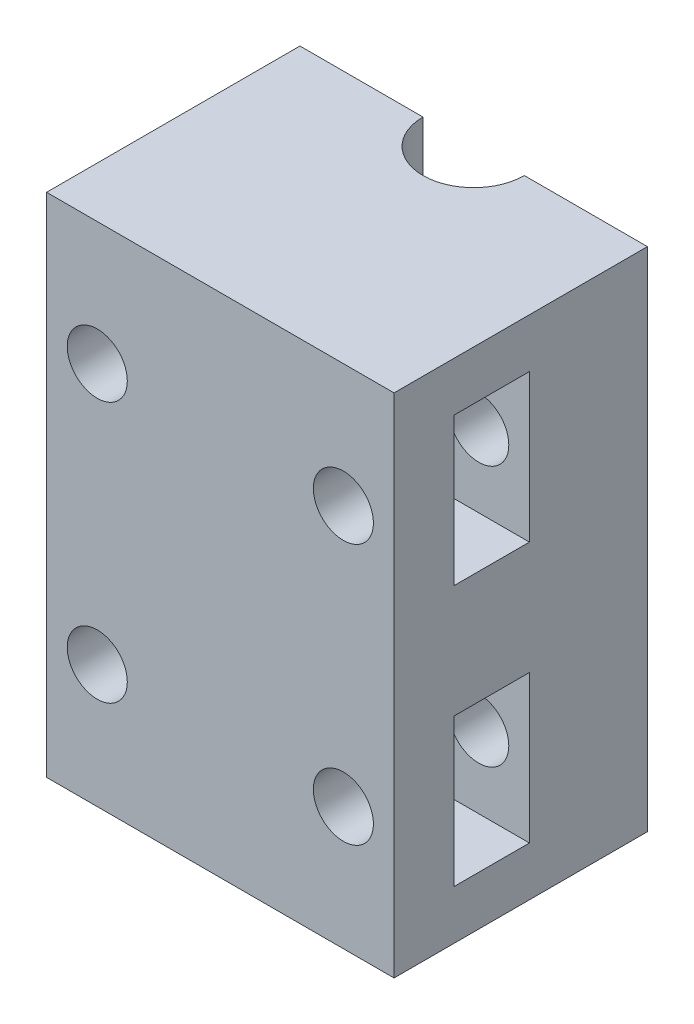
ISO-10303-21;
HEADER;
FILE_DESCRIPTION(('STEP AP214'),'2;1');
FILE_NAME('part.step','',(''),(''),'','','');
FILE_SCHEMA(('AUTOMOTIVE_DESIGN { 1 0 10303 214 1 1 1 1 }'));
ENDSEC;
DATA;
#1=APPLICATION_CONTEXT('core data for automotive mechanical design processes');
#2=APPLICATION_PROTOCOL_DEFINITION('international standard','automotive_design',2000,#1);
#3=PRODUCT_CONTEXT('',#1,'mechanical');
#4=PRODUCT('Part','Part','',(#3));
#5=PRODUCT_RELATED_PRODUCT_CATEGORY('part','',(#4));
#6=PRODUCT_DEFINITION_FORMATION('','',#4);
#7=PRODUCT_DEFINITION_CONTEXT('part definition',#1,'design');
#8=PRODUCT_DEFINITION('design','',#6,#7);
#9=PRODUCT_DEFINITION_SHAPE('','',#8);
#10=(LENGTH_UNIT() NAMED_UNIT(*) SI_UNIT(.MILLI.,.METRE.));
#11=(NAMED_UNIT(*) PLANE_ANGLE_UNIT() SI_UNIT($,.RADIAN.));
#12=(NAMED_UNIT(*) SI_UNIT($,.STERADIAN.) SOLID_ANGLE_UNIT());
#13=UNCERTAINTY_MEASURE_WITH_UNIT(LENGTH_MEASURE(1.E-05),#10,'distance_accuracy_value','');
#14=(GEOMETRIC_REPRESENTATION_CONTEXT(3) GLOBAL_UNCERTAINTY_ASSIGNED_CONTEXT((#13)) GLOBAL_UNIT_ASSIGNED_CONTEXT((#10,
#11,#12)) REPRESENTATION_CONTEXT('',''));
#15=CARTESIAN_POINT('',(0.,0.,0.));
#16=DIRECTION('',(0.,0.,1.));
#17=DIRECTION('',(1.,0.,0.));
#18=AXIS2_PLACEMENT_3D('',#15,#16,#17);
#19=CARTESIAN_POINT('',(24.,70.,-17.5));
#20=DIRECTION('',(0.,0.,1.));
#21=DIRECTION('',(1.,0.,0.));
#22=AXIS2_PLACEMENT_3D('',#19,#20,#21);
#23=PLANE('',#22);
#24=CARTESIAN_POINT('',(-17.,53.,-17.5));
#25=DIRECTION('',(0.,0.,1.));
#26=DIRECTION('',(1.,0.,0.));
#27=AXIS2_PLACEMENT_3D('',#24,#25,#26);
#28=CIRCLE('',#27,4.15);
#29=CARTESIAN_POINT('',(-12.85,53.,-17.5));
#30=VERTEX_POINT('',#29);
#31=EDGE_CURVE('E223',#30,#30,#28,.T.);
#32=ORIENTED_EDGE('',*,*,#31,.T.);
#33=EDGE_LOOP('',(#32));
#34=FACE_BOUND('',#33,.T.);
#35=CARTESIAN_POINT('',(-17.,17.,-17.5));
#36=DIRECTION('',(0.,0.,1.));
#37=DIRECTION('',(1.,0.,0.));
#38=AXIS2_PLACEMENT_3D('',#35,#36,#37);
#39=CIRCLE('',#38,4.15);
#40=CARTESIAN_POINT('',(-12.85,17.,-17.5));
#41=VERTEX_POINT('',#40);
#42=EDGE_CURVE('E198',#41,#41,#39,.T.);
#43=ORIENTED_EDGE('',*,*,#42,.T.);
#44=EDGE_LOOP('',(#43));
#45=FACE_BOUND('',#44,.T.);
#46=DIRECTION('',(0.,-1.,0.));
#47=VECTOR('',#46,1.);
#48=CARTESIAN_POINT('',(-7.,249.629897921023,-17.5));
#49=LINE('',#48,#47);
#50=CARTESIAN_POINT('',(-7.,70.,-17.5));
#51=VERTEX_POINT('',#50);
#52=CARTESIAN_POINT('',(-7.,0.,-17.5));
#53=VERTEX_POINT('',#52);
#54=EDGE_CURVE('E181',#51,#53,#49,.T.);
#55=ORIENTED_EDGE('',*,*,#54,.T.);
#56=DIRECTION('',(-1.,0.,0.));
#57=VECTOR('',#56,1.);
#58=CARTESIAN_POINT('',(24.,0.,-17.5));
#59=LINE('',#58,#57);
#60=CARTESIAN_POINT('',(-24.,0.,-17.5));
#61=VERTEX_POINT('',#60);
#62=EDGE_CURVE('E168',#53,#61,#59,.T.);
#63=ORIENTED_EDGE('',*,*,#62,.T.);
#64=DIRECTION('',(0.,-1.,0.));
#65=VECTOR('',#64,1.);
#66=CARTESIAN_POINT('',(-24.,70.,-17.5));
#67=LINE('',#66,#65);
#68=CARTESIAN_POINT('',(-24.,70.,-17.5));
#69=VERTEX_POINT('',#68);
#70=EDGE_CURVE('E308',#69,#61,#67,.T.);
#71=ORIENTED_EDGE('',*,*,#70,.F.);
#72=DIRECTION('',(-1.,0.,0.));
#73=VECTOR('',#72,1.);
#74=CARTESIAN_POINT('',(24.,70.,-17.5));
#75=LINE('',#74,#73);
#76=EDGE_CURVE('E182',#51,#69,#75,.T.);
#77=ORIENTED_EDGE('',*,*,#76,.F.);
#78=EDGE_LOOP('',(#55,#63,#71,#77));
#79=FACE_BOUND('',#78,.T.);
#80=ADVANCED_FACE('F42',(#34,#45,#79),#23,.F.);
#81=CARTESIAN_POINT('',(17.,17.,-17.5));
#82=DIRECTION('',(0.,0.,1.));
#83=DIRECTION('',(1.,0.,0.));
#84=AXIS2_PLACEMENT_3D('',#81,#82,#83);
#85=CIRCLE('',#84,4.15);
#86=CARTESIAN_POINT('',(21.15,17.,-17.5));
#87=VERTEX_POINT('',#86);
#88=EDGE_CURVE('E204',#87,#87,#85,.T.);
#89=ORIENTED_EDGE('',*,*,#88,.T.);
#90=EDGE_LOOP('',(#89));
#91=FACE_BOUND('',#90,.T.);
#92=CARTESIAN_POINT('',(17.,53.,-17.5));
#93=DIRECTION('',(0.,0.,1.));
#94=DIRECTION('',(1.,0.,0.));
#95=AXIS2_PLACEMENT_3D('',#92,#93,#94);
#96=CIRCLE('',#95,4.15);
#97=CARTESIAN_POINT('',(21.15,53.,-17.5));
#98=VERTEX_POINT('',#97);
#99=EDGE_CURVE('E191',#98,#98,#96,.T.);
#100=ORIENTED_EDGE('',*,*,#99,.T.);
#101=EDGE_LOOP('',(#100));
#102=FACE_BOUND('',#101,.T.);
#103=DIRECTION('',(0.,-1.,0.));
#104=VECTOR('',#103,1.);
#105=CARTESIAN_POINT('',(7.,249.629897921023,-17.5));
#106=LINE('',#105,#104);
#107=CARTESIAN_POINT('',(7.,70.,-17.5));
#108=VERTEX_POINT('',#107);
#109=CARTESIAN_POINT('',(7.,0.,-17.5));
#110=VERTEX_POINT('',#109);
#111=EDGE_CURVE('E65',#108,#110,#106,.T.);
#112=ORIENTED_EDGE('',*,*,#111,.F.);
#113=CARTESIAN_POINT('',(24.,70.,-17.5));
#114=VERTEX_POINT('',#113);
#115=EDGE_CURVE('E306',#114,#108,#75,.T.);
#116=ORIENTED_EDGE('',*,*,#115,.F.);
#117=DIRECTION('',(0.,-1.,0.));
#118=VECTOR('',#117,1.);
#119=CARTESIAN_POINT('',(24.,70.,-17.5));
#120=LINE('',#119,#118);
#121=CARTESIAN_POINT('',(24.,0.,-17.5));
#122=VERTEX_POINT('',#121);
#123=EDGE_CURVE('E315',#114,#122,#120,.T.);
#124=ORIENTED_EDGE('',*,*,#123,.T.);
#125=EDGE_CURVE('E177',#122,#110,#59,.T.);
#126=ORIENTED_EDGE('',*,*,#125,.T.);
#127=EDGE_LOOP('',(#112,#116,#124,#126));
#128=FACE_BOUND('',#127,.T.);
#129=ADVANCED_FACE('F359',(#91,#102,#128),#23,.F.);
#130=CARTESIAN_POINT('',(0.,70.,0.));
#131=DIRECTION('',(0.,1.,0.));
#132=DIRECTION('',(0.,0.,1.));
#133=AXIS2_PLACEMENT_3D('',#130,#131,#132);
#134=PLANE('',#133);
#135=ORIENTED_EDGE('',*,*,#115,.T.);
#136=CARTESIAN_POINT('',(0.,70.,-17.5));
#137=DIRECTION('',(0.,1.,0.));
#138=DIRECTION('',(0.,0.,1.));
#139=AXIS2_PLACEMENT_3D('',#136,#137,#138);
#140=CIRCLE('',#139,7.);
#141=EDGE_CURVE('E57',#108,#51,#140,.F.);
#142=ORIENTED_EDGE('',*,*,#141,.T.);
#143=ORIENTED_EDGE('',*,*,#76,.T.);
#144=DIRECTION('',(0.,0.,1.));
#145=VECTOR('',#144,1.);
#146=CARTESIAN_POINT('',(-24.,70.,17.5));
#147=LINE('',#146,#145);
#148=CARTESIAN_POINT('',(-24.,70.,17.5));
#149=VERTEX_POINT('',#148);
#150=EDGE_CURVE('E298',#69,#149,#147,.T.);
#151=ORIENTED_EDGE('',*,*,#150,.T.);
#152=DIRECTION('',(1.,0.,0.));
#153=VECTOR('',#152,1.);
#154=CARTESIAN_POINT('',(24.,70.,17.5));
#155=LINE('',#154,#153);
#156=CARTESIAN_POINT('',(24.,70.,17.5));
#157=VERTEX_POINT('',#156);
#158=EDGE_CURVE('E301',#149,#157,#155,.T.);
#159=ORIENTED_EDGE('',*,*,#158,.T.);
#160=DIRECTION('',(0.,0.,-1.));
#161=VECTOR('',#160,1.);
#162=CARTESIAN_POINT('',(24.,70.,17.5));
#163=LINE('',#162,#161);
#164=EDGE_CURVE('E303',#157,#114,#163,.T.);
#165=ORIENTED_EDGE('',*,*,#164,.T.);
#166=EDGE_LOOP('',(#135,#142,#143,#151,#159,#165));
#167=FACE_BOUND('',#166,.T.);
#168=ADVANCED_FACE('F365',(#167),#134,.T.);
#169=CARTESIAN_POINT('',(0.,0.,0.));
#170=DIRECTION('',(0.,1.,0.));
#171=DIRECTION('',(0.,0.,1.));
#172=AXIS2_PLACEMENT_3D('',#169,#170,#171);
#173=PLANE('',#172);
#174=CARTESIAN_POINT('',(0.,0.,-17.5));
#175=DIRECTION('',(0.,1.,0.));
#176=DIRECTION('',(0.,0.,1.));
#177=AXIS2_PLACEMENT_3D('',#174,#175,#176);
#178=CIRCLE('',#177,7.);
#179=EDGE_CURVE('E12',#110,#53,#178,.F.);
#180=ORIENTED_EDGE('',*,*,#179,.F.);
#181=ORIENTED_EDGE('',*,*,#125,.F.);
#182=DIRECTION('',(0.,0.,-1.));
#183=VECTOR('',#182,1.);
#184=CARTESIAN_POINT('',(24.,0.,17.5));
#185=LINE('',#184,#183);
#186=CARTESIAN_POINT('',(24.,0.,17.5));
#187=VERTEX_POINT('',#186);
#188=EDGE_CURVE('E178',#187,#122,#185,.T.);
#189=ORIENTED_EDGE('',*,*,#188,.F.);
#190=DIRECTION('',(1.,0.,0.));
#191=VECTOR('',#190,1.);
#192=CARTESIAN_POINT('',(24.,0.,17.5));
#193=LINE('',#192,#191);
#194=CARTESIAN_POINT('',(-24.,0.,17.5));
#195=VERTEX_POINT('',#194);
#196=EDGE_CURVE('E310',#195,#187,#193,.T.);
#197=ORIENTED_EDGE('',*,*,#196,.F.);
#198=DIRECTION('',(0.,0.,1.));
#199=VECTOR('',#198,1.);
#200=CARTESIAN_POINT('',(-24.,0.,17.5));
#201=LINE('',#200,#199);
#202=EDGE_CURVE('E173',#61,#195,#201,.T.);
#203=ORIENTED_EDGE('',*,*,#202,.F.);
#204=ORIENTED_EDGE('',*,*,#62,.F.);
#205=EDGE_LOOP('',(#180,#181,#189,#197,#203,#204));
#206=FACE_BOUND('',#205,.T.);
#207=ADVANCED_FACE('F170',(#206),#173,.F.);
#208=CARTESIAN_POINT('',(-21.,70.,17.5));
#209=DIRECTION('',(1.,0.,0.));
#210=DIRECTION('',(0.,0.,-1.));
#211=AXIS2_PLACEMENT_3D('',#208,#209,#210);
#212=PLANE('',#211);
#213=DIRECTION('',(0.,0.,1.));
#214=VECTOR('',#213,1.);
#215=CARTESIAN_POINT('',(-21.,18.1056672193748,-17.5));
#216=LINE('',#215,#214);
#217=CARTESIAN_POINT('',(-21.,18.1056672193748,-1.20000000000001));
#218=VERTEX_POINT('',#217);
#219=CARTESIAN_POINT('',(-21.,18.1056672193748,9.19999999999999));
#220=VERTEX_POINT('',#219);
#221=EDGE_CURVE('E50',#218,#220,#216,.T.);
#222=ORIENTED_EDGE('',*,*,#221,.F.);
#223=DIRECTION('',(0.,-1.,0.));
#224=VECTOR('',#223,1.);
#225=CARTESIAN_POINT('',(-21.,6.8,-1.20000000000001));
#226=LINE('',#225,#224);
#227=CARTESIAN_POINT('',(-21.,27.2,-1.20000000000001));
#228=VERTEX_POINT('',#227);
#229=EDGE_CURVE('E235',#228,#218,#226,.T.);
#230=ORIENTED_EDGE('',*,*,#229,.F.);
#231=DIRECTION('',(0.,0.,-1.));
#232=VECTOR('',#231,1.);
#233=CARTESIAN_POINT('',(-21.,27.2,-1.20000000000001));
#234=LINE('',#233,#232);
#235=CARTESIAN_POINT('',(-21.,27.2,9.19999999999999));
#236=VERTEX_POINT('',#235);
#237=EDGE_CURVE('E238',#236,#228,#234,.T.);
#238=ORIENTED_EDGE('',*,*,#237,.F.);
#239=DIRECTION('',(0.,1.,0.));
#240=VECTOR('',#239,1.);
#241=CARTESIAN_POINT('',(-21.,6.8,9.19999999999999));
#242=LINE('',#241,#240);
#243=EDGE_CURVE('E241',#220,#236,#242,.T.);
#244=ORIENTED_EDGE('',*,*,#243,.F.);
#245=EDGE_LOOP('',(#222,#230,#238,#244));
#246=FACE_BOUND('',#245,.T.);
#247=ADVANCED_FACE('F402',(#246),#212,.T.);
#248=CARTESIAN_POINT('',(-21.,70.,17.5));
#249=DIRECTION('',(1.,0.,0.));
#250=DIRECTION('',(0.,0.,-1.));
#251=AXIS2_PLACEMENT_3D('',#248,#249,#250);
#252=PLANE('',#251);
#253=DIRECTION('',(0.,0.,1.));
#254=VECTOR('',#253,1.);
#255=CARTESIAN_POINT('',(-21.,54.1056672193749,-17.5));
#256=LINE('',#255,#254);
#257=CARTESIAN_POINT('',(-21.,54.1056672193749,-1.20000000000001));
#258=VERTEX_POINT('',#257);
#259=CARTESIAN_POINT('',(-21.,54.1056672193749,9.19999999999999));
#260=VERTEX_POINT('',#259);
#261=EDGE_CURVE('E328',#258,#260,#256,.T.);
#262=ORIENTED_EDGE('',*,*,#261,.F.);
#263=DIRECTION('',(0.,-1.,0.));
#264=VECTOR('',#263,1.);
#265=CARTESIAN_POINT('',(-21.,42.8,-1.20000000000001));
#266=LINE('',#265,#264);
#267=CARTESIAN_POINT('',(-21.,63.2,-1.20000000000001));
#268=VERTEX_POINT('',#267);
#269=EDGE_CURVE('E267',#268,#258,#266,.T.);
#270=ORIENTED_EDGE('',*,*,#269,.F.);
#271=DIRECTION('',(0.,0.,-1.));
#272=VECTOR('',#271,1.);
#273=CARTESIAN_POINT('',(-21.,63.2,-1.20000000000001));
#274=LINE('',#273,#272);
#275=CARTESIAN_POINT('',(-21.,63.2,9.19999999999999));
#276=VERTEX_POINT('',#275);
#277=EDGE_CURVE('E270',#276,#268,#274,.T.);
#278=ORIENTED_EDGE('',*,*,#277,.F.);
#279=DIRECTION('',(0.,1.,0.));
#280=VECTOR('',#279,1.);
#281=CARTESIAN_POINT('',(-21.,42.8,9.19999999999999));
#282=LINE('',#281,#280);
#283=EDGE_CURVE('E273',#260,#276,#282,.T.);
#284=ORIENTED_EDGE('',*,*,#283,.F.);
#285=EDGE_LOOP('',(#262,#270,#278,#284));
#286=FACE_BOUND('',#285,.T.);
#287=ADVANCED_FACE('F381',(#286),#252,.T.);
#288=CARTESIAN_POINT('',(-24.,70.,17.5));
#289=DIRECTION('',(1.,0.,0.));
#290=DIRECTION('',(0.,0.,-1.));
#291=AXIS2_PLACEMENT_3D('',#288,#289,#290);
#292=PLANE('',#291);
#293=ORIENTED_EDGE('',*,*,#202,.T.);
#294=DIRECTION('',(0.,-1.,0.));
#295=VECTOR('',#294,1.);
#296=CARTESIAN_POINT('',(-24.,70.,17.5));
#297=LINE('',#296,#295);
#298=EDGE_CURVE('E323',#149,#195,#297,.T.);
#299=ORIENTED_EDGE('',*,*,#298,.F.);
#300=ORIENTED_EDGE('',*,*,#150,.F.);
#301=ORIENTED_EDGE('',*,*,#70,.T.);
#302=EDGE_LOOP('',(#293,#299,#300,#301));
#303=FACE_BOUND('',#302,.T.);
#304=ADVANCED_FACE('F44',(#303),#292,.F.);
#305=CARTESIAN_POINT('',(24.,70.,17.5));
#306=DIRECTION('',(0.,0.,-1.));
#307=DIRECTION('',(-1.,0.,0.));
#308=AXIS2_PLACEMENT_3D('',#305,#306,#307);
#309=PLANE('',#308);
#310=CARTESIAN_POINT('',(17.,53.,17.5));
#311=DIRECTION('',(0.,0.,1.));
#312=DIRECTION('',(1.,0.,0.));
#313=AXIS2_PLACEMENT_3D('',#310,#311,#312);
#314=CIRCLE('',#313,4.15);
#315=CARTESIAN_POINT('',(21.15,53.,17.5));
#316=VERTEX_POINT('',#315);
#317=EDGE_CURVE('E195',#316,#316,#314,.T.);
#318=ORIENTED_EDGE('',*,*,#317,.F.);
#319=EDGE_LOOP('',(#318));
#320=FACE_BOUND('',#319,.T.);
#321=CARTESIAN_POINT('',(-17.,17.,17.5));
#322=DIRECTION('',(0.,0.,1.));
#323=DIRECTION('',(1.,0.,0.));
#324=AXIS2_PLACEMENT_3D('',#321,#322,#323);
#325=CIRCLE('',#324,4.15);
#326=CARTESIAN_POINT('',(-12.85,17.,17.5));
#327=VERTEX_POINT('',#326);
#328=EDGE_CURVE('E201',#327,#327,#325,.T.);
#329=ORIENTED_EDGE('',*,*,#328,.F.);
#330=EDGE_LOOP('',(#329));
#331=FACE_BOUND('',#330,.T.);
#332=CARTESIAN_POINT('',(17.,17.,17.5));
#333=DIRECTION('',(0.,0.,1.));
#334=DIRECTION('',(1.,0.,0.));
#335=AXIS2_PLACEMENT_3D('',#332,#333,#334);
#336=CIRCLE('',#335,4.15);
#337=CARTESIAN_POINT('',(21.15,17.,17.5));
#338=VERTEX_POINT('',#337);
#339=EDGE_CURVE('E188',#338,#338,#336,.T.);
#340=ORIENTED_EDGE('',*,*,#339,.F.);
#341=EDGE_LOOP('',(#340));
#342=FACE_BOUND('',#341,.T.);
#343=CARTESIAN_POINT('',(-17.,53.,17.5));
#344=DIRECTION('',(0.,0.,1.));
#345=DIRECTION('',(1.,0.,0.));
#346=AXIS2_PLACEMENT_3D('',#343,#344,#345);
#347=CIRCLE('',#346,4.15);
#348=CARTESIAN_POINT('',(-12.85,53.,17.5));
#349=VERTEX_POINT('',#348);
#350=EDGE_CURVE('E222',#349,#349,#347,.T.);
#351=ORIENTED_EDGE('',*,*,#350,.F.);
#352=EDGE_LOOP('',(#351));
#353=FACE_BOUND('',#352,.T.);
#354=ORIENTED_EDGE('',*,*,#196,.T.);
#355=DIRECTION('',(0.,-1.,0.));
#356=VECTOR('',#355,1.);
#357=CARTESIAN_POINT('',(24.,70.,17.5));
#358=LINE('',#357,#356);
#359=EDGE_CURVE('E319',#157,#187,#358,.T.);
#360=ORIENTED_EDGE('',*,*,#359,.F.);
#361=ORIENTED_EDGE('',*,*,#158,.F.);
#362=ORIENTED_EDGE('',*,*,#298,.T.);
#363=EDGE_LOOP('',(#354,#360,#361,#362));
#364=FACE_BOUND('',#363,.T.);
#365=ADVANCED_FACE('F374',(#320,#331,#342,#353,#364),#309,.F.);
#366=CARTESIAN_POINT('',(24.,70.,17.5));
#367=DIRECTION('',(-1.,0.,0.));
#368=DIRECTION('',(0.,0.,1.));
#369=AXIS2_PLACEMENT_3D('',#366,#367,#368);
#370=PLANE('',#369);
#371=DIRECTION('',(0.,0.,-1.));
#372=VECTOR('',#371,1.);
#373=CARTESIAN_POINT('',(24.,6.8,-1.20000000000001));
#374=LINE('',#373,#372);
#375=CARTESIAN_POINT('',(24.,6.8,9.19999999999999));
#376=VERTEX_POINT('',#375);
#377=CARTESIAN_POINT('',(24.,6.8,-1.20000000000001));
#378=VERTEX_POINT('',#377);
#379=EDGE_CURVE('E247',#376,#378,#374,.T.);
#380=ORIENTED_EDGE('',*,*,#379,.F.);
#381=DIRECTION('',(0.,-1.,0.));
#382=VECTOR('',#381,1.);
#383=CARTESIAN_POINT('',(24.,6.8,9.19999999999999));
#384=LINE('',#383,#382);
#385=CARTESIAN_POINT('',(24.,27.2,9.19999999999999));
#386=VERTEX_POINT('',#385);
#387=EDGE_CURVE('E234',#386,#376,#384,.T.);
#388=ORIENTED_EDGE('',*,*,#387,.F.);
#389=DIRECTION('',(0.,0.,1.));
#390=VECTOR('',#389,1.);
#391=CARTESIAN_POINT('',(24.,27.2,-1.20000000000001));
#392=LINE('',#391,#390);
#393=CARTESIAN_POINT('',(24.,27.2,-1.20000000000001));
#394=VERTEX_POINT('',#393);
#395=EDGE_CURVE('E253',#394,#386,#392,.T.);
#396=ORIENTED_EDGE('',*,*,#395,.F.);
#397=DIRECTION('',(0.,1.,0.));
#398=VECTOR('',#397,1.);
#399=CARTESIAN_POINT('',(24.,6.8,-1.20000000000001));
#400=LINE('',#399,#398);
#401=EDGE_CURVE('E250',#378,#394,#400,.T.);
#402=ORIENTED_EDGE('',*,*,#401,.F.);
#403=EDGE_LOOP('',(#380,#388,#396,#402));
#404=FACE_BOUND('',#403,.T.);
#405=DIRECTION('',(0.,0.,-1.));
#406=VECTOR('',#405,1.);
#407=CARTESIAN_POINT('',(24.,42.8,-1.20000000000001));
#408=LINE('',#407,#406);
#409=CARTESIAN_POINT('',(24.,42.8,9.19999999999999));
#410=VERTEX_POINT('',#409);
#411=CARTESIAN_POINT('',(24.,42.8,-1.20000000000001));
#412=VERTEX_POINT('',#411);
#413=EDGE_CURVE('E279',#410,#412,#408,.T.);
#414=ORIENTED_EDGE('',*,*,#413,.F.);
#415=DIRECTION('',(0.,-1.,0.));
#416=VECTOR('',#415,1.);
#417=CARTESIAN_POINT('',(24.,42.8,9.19999999999999));
#418=LINE('',#417,#416);
#419=CARTESIAN_POINT('',(24.,63.2,9.19999999999999));
#420=VERTEX_POINT('',#419);
#421=EDGE_CURVE('E266',#420,#410,#418,.T.);
#422=ORIENTED_EDGE('',*,*,#421,.F.);
#423=DIRECTION('',(0.,0.,1.));
#424=VECTOR('',#423,1.);
#425=CARTESIAN_POINT('',(24.,63.2,-1.20000000000001));
#426=LINE('',#425,#424);
#427=CARTESIAN_POINT('',(24.,63.2,-1.20000000000001));
#428=VERTEX_POINT('',#427);
#429=EDGE_CURVE('E285',#428,#420,#426,.T.);
#430=ORIENTED_EDGE('',*,*,#429,.F.);
#431=DIRECTION('',(0.,1.,0.));
#432=VECTOR('',#431,1.);
#433=CARTESIAN_POINT('',(24.,42.8,-1.20000000000001));
#434=LINE('',#433,#432);
#435=EDGE_CURVE('E282',#412,#428,#434,.T.);
#436=ORIENTED_EDGE('',*,*,#435,.F.);
#437=EDGE_LOOP('',(#414,#422,#430,#436));
#438=FACE_BOUND('',#437,.T.);
#439=ORIENTED_EDGE('',*,*,#188,.T.);
#440=ORIENTED_EDGE('',*,*,#123,.F.);
#441=ORIENTED_EDGE('',*,*,#164,.F.);
#442=ORIENTED_EDGE('',*,*,#359,.T.);
#443=EDGE_LOOP('',(#439,#440,#441,#442));
#444=FACE_BOUND('',#443,.T.);
#445=ADVANCED_FACE('F371',(#404,#438,#444),#370,.F.);
#446=CARTESIAN_POINT('',(-46.8980348501788,42.8,9.19999999999999));
#447=DIRECTION('',(0.,0.,1.));
#448=DIRECTION('',(1.,0.,0.));
#449=AXIS2_PLACEMENT_3D('',#446,#447,#448);
#450=PLANE('',#449);
#451=CARTESIAN_POINT('',(17.,53.,9.19999999999999));
#452=DIRECTION('',(0.,0.,1.));
#453=DIRECTION('',(1.,0.,0.));
#454=AXIS2_PLACEMENT_3D('',#451,#452,#453);
#455=CIRCLE('',#454,4.15);
#456=CARTESIAN_POINT('',(21.15,53.,9.19999999999999));
#457=VERTEX_POINT('',#456);
#458=EDGE_CURVE('E219',#457,#457,#455,.T.);
#459=ORIENTED_EDGE('',*,*,#458,.T.);
#460=EDGE_LOOP('',(#459));
#461=FACE_BOUND('',#460,.T.);
#462=CARTESIAN_POINT('',(-21.,42.8,9.19999999999999));
#463=VERTEX_POINT('',#462);
#464=CARTESIAN_POINT('',(-21.,51.8943327806251,9.19999999999999));
#465=VERTEX_POINT('',#464);
#466=EDGE_CURVE('E274',#463,#465,#282,.T.);
#467=ORIENTED_EDGE('',*,*,#466,.T.);
#468=CARTESIAN_POINT('',(-17.,53.,9.19999999999999));
#469=DIRECTION('',(0.,0.,1.));
#470=DIRECTION('',(1.,0.,0.));
#471=AXIS2_PLACEMENT_3D('',#468,#469,#470);
#472=CIRCLE('',#471,4.15);
#473=EDGE_CURVE('E231',#465,#260,#472,.T.);
#474=ORIENTED_EDGE('',*,*,#473,.T.);
#475=ORIENTED_EDGE('',*,*,#283,.T.);
#476=DIRECTION('',(1.,0.,0.));
#477=VECTOR('',#476,1.);
#478=CARTESIAN_POINT('',(-46.8980348501788,63.2,9.19999999999999));
#479=LINE('',#478,#477);
#480=EDGE_CURVE('E289',#276,#420,#479,.T.);
#481=ORIENTED_EDGE('',*,*,#480,.T.);
#482=ORIENTED_EDGE('',*,*,#421,.T.);
#483=DIRECTION('',(1.,0.,0.));
#484=VECTOR('',#483,1.);
#485=CARTESIAN_POINT('',(-46.8980348501788,42.8,9.19999999999999));
#486=LINE('',#485,#484);
#487=EDGE_CURVE('E288',#463,#410,#486,.T.);
#488=ORIENTED_EDGE('',*,*,#487,.F.);
#489=EDGE_LOOP('',(#467,#474,#475,#481,#482,#488));
#490=FACE_BOUND('',#489,.T.);
#491=ADVANCED_FACE('F373',(#461,#490),#450,.F.);
#492=CARTESIAN_POINT('',(-46.8980348501788,63.2,-1.20000000000001));
#493=DIRECTION('',(0.,1.,0.));
#494=DIRECTION('',(0.,0.,1.));
#495=AXIS2_PLACEMENT_3D('',#492,#493,#494);
#496=PLANE('',#495);
#497=ORIENTED_EDGE('',*,*,#277,.T.);
#498=DIRECTION('',(1.,0.,0.));
#499=VECTOR('',#498,1.);
#500=CARTESIAN_POINT('',(-46.8980348501788,63.2,-1.20000000000001));
#501=LINE('',#500,#499);
#502=EDGE_CURVE('E291',#268,#428,#501,.T.);
#503=ORIENTED_EDGE('',*,*,#502,.T.);
#504=ORIENTED_EDGE('',*,*,#429,.T.);
#505=ORIENTED_EDGE('',*,*,#480,.F.);
#506=EDGE_LOOP('',(#497,#503,#504,#505));
#507=FACE_BOUND('',#506,.T.);
#508=ADVANCED_FACE('F406',(#507),#496,.F.);
#509=CARTESIAN_POINT('',(-46.8980348501788,42.8,-1.20000000000001));
#510=DIRECTION('',(0.,0.,-1.));
#511=DIRECTION('',(0.,1.,0.));
#512=AXIS2_PLACEMENT_3D('',#509,#510,#511);
#513=PLANE('',#512);
#514=CARTESIAN_POINT('',(17.,53.,-1.20000000000001));
#515=DIRECTION('',(0.,0.,-1.));
#516=DIRECTION('',(0.,1.,0.));
#517=AXIS2_PLACEMENT_3D('',#514,#515,#516);
#518=CIRCLE('',#517,4.15);
#519=CARTESIAN_POINT('',(17.,57.15,-1.20000000000001));
#520=VERTEX_POINT('',#519);
#521=EDGE_CURVE('E218',#520,#520,#518,.T.);
#522=ORIENTED_EDGE('',*,*,#521,.T.);
#523=EDGE_LOOP('',(#522));
#524=FACE_BOUND('',#523,.T.);
#525=ORIENTED_EDGE('',*,*,#269,.T.);
#526=CARTESIAN_POINT('',(-17.,53.,-1.20000000000001));
#527=DIRECTION('',(0.,0.,-1.));
#528=DIRECTION('',(0.,1.,0.));
#529=AXIS2_PLACEMENT_3D('',#526,#527,#528);
#530=CIRCLE('',#529,4.15);
#531=CARTESIAN_POINT('',(-21.,51.8943327806251,-1.20000000000001));
#532=VERTEX_POINT('',#531);
#533=EDGE_CURVE('E226',#258,#532,#530,.T.);
#534=ORIENTED_EDGE('',*,*,#533,.T.);
#535=CARTESIAN_POINT('',(-21.,42.8,-1.20000000000001));
#536=VERTEX_POINT('',#535);
#537=EDGE_CURVE('E271',#532,#536,#266,.T.);
#538=ORIENTED_EDGE('',*,*,#537,.T.);
#539=DIRECTION('',(1.,0.,0.));
#540=VECTOR('',#539,1.);
#541=CARTESIAN_POINT('',(-46.8980348501788,42.8,-1.20000000000001));
#542=LINE('',#541,#540);
#543=EDGE_CURVE('E293',#536,#412,#542,.T.);
#544=ORIENTED_EDGE('',*,*,#543,.T.);
#545=ORIENTED_EDGE('',*,*,#435,.T.);
#546=ORIENTED_EDGE('',*,*,#502,.F.);
#547=EDGE_LOOP('',(#525,#534,#538,#544,#545,#546));
#548=FACE_BOUND('',#547,.T.);
#549=ADVANCED_FACE('F338',(#524,#548),#513,.F.);
#550=CARTESIAN_POINT('',(-46.8980348501788,42.8,-1.20000000000001));
#551=DIRECTION('',(0.,-1.,0.));
#552=DIRECTION('',(0.,0.,-1.));
#553=AXIS2_PLACEMENT_3D('',#550,#551,#552);
#554=PLANE('',#553);
#555=DIRECTION('',(0.,0.,1.));
#556=VECTOR('',#555,1.);
#557=CARTESIAN_POINT('',(-21.,42.8,-1.20000000000001));
#558=LINE('',#557,#556);
#559=EDGE_CURVE('E277',#536,#463,#558,.T.);
#560=ORIENTED_EDGE('',*,*,#559,.T.);
#561=ORIENTED_EDGE('',*,*,#487,.T.);
#562=ORIENTED_EDGE('',*,*,#413,.T.);
#563=ORIENTED_EDGE('',*,*,#543,.F.);
#564=EDGE_LOOP('',(#560,#561,#562,#563));
#565=FACE_BOUND('',#564,.T.);
#566=ADVANCED_FACE('F408',(#565),#554,.F.);
#567=DIRECTION('',(0.,0.,1.));
#568=VECTOR('',#567,1.);
#569=CARTESIAN_POINT('',(-21.,51.8943327806251,-17.5));
#570=LINE('',#569,#568);
#571=EDGE_CURVE('E326',#465,#532,#570,.F.);
#572=ORIENTED_EDGE('',*,*,#571,.F.);
#573=ORIENTED_EDGE('',*,*,#466,.F.);
#574=ORIENTED_EDGE('',*,*,#559,.F.);
#575=ORIENTED_EDGE('',*,*,#537,.F.);
#576=EDGE_LOOP('',(#572,#573,#574,#575));
#577=FACE_BOUND('',#576,.T.);
#578=ADVANCED_FACE('F411',(#577),#252,.T.);
#579=CARTESIAN_POINT('',(-46.8980348501788,6.8,9.19999999999999));
#580=DIRECTION('',(0.,0.,1.));
#581=DIRECTION('',(1.,0.,0.));
#582=AXIS2_PLACEMENT_3D('',#579,#580,#581);
#583=PLANE('',#582);
#584=CARTESIAN_POINT('',(17.,17.,9.19999999999999));
#585=DIRECTION('',(0.,0.,1.));
#586=DIRECTION('',(1.,0.,0.));
#587=AXIS2_PLACEMENT_3D('',#584,#585,#586);
#588=CIRCLE('',#587,4.15);
#589=CARTESIAN_POINT('',(21.15,17.,9.19999999999999));
#590=VERTEX_POINT('',#589);
#591=EDGE_CURVE('E215',#590,#590,#588,.T.);
#592=ORIENTED_EDGE('',*,*,#591,.T.);
#593=EDGE_LOOP('',(#592));
#594=FACE_BOUND('',#593,.T.);
#595=CARTESIAN_POINT('',(-21.,6.8,9.19999999999999));
#596=VERTEX_POINT('',#595);
#597=CARTESIAN_POINT('',(-21.,15.8943327806252,9.19999999999999));
#598=VERTEX_POINT('',#597);
#599=EDGE_CURVE('E242',#596,#598,#242,.T.);
#600=ORIENTED_EDGE('',*,*,#599,.T.);
#601=CARTESIAN_POINT('',(-17.,17.,9.19999999999999));
#602=DIRECTION('',(0.,0.,1.));
#603=DIRECTION('',(1.,0.,0.));
#604=AXIS2_PLACEMENT_3D('',#601,#602,#603);
#605=CIRCLE('',#604,4.15);
#606=EDGE_CURVE('E211',#598,#220,#605,.T.);
#607=ORIENTED_EDGE('',*,*,#606,.T.);
#608=ORIENTED_EDGE('',*,*,#243,.T.);
#609=DIRECTION('',(1.,0.,0.));
#610=VECTOR('',#609,1.);
#611=CARTESIAN_POINT('',(-46.8980348501788,27.2,9.19999999999999));
#612=LINE('',#611,#610);
#613=EDGE_CURVE('E257',#236,#386,#612,.T.);
#614=ORIENTED_EDGE('',*,*,#613,.T.);
#615=ORIENTED_EDGE('',*,*,#387,.T.);
#616=DIRECTION('',(1.,0.,0.));
#617=VECTOR('',#616,1.);
#618=CARTESIAN_POINT('',(-46.8980348501788,6.8,9.19999999999999));
#619=LINE('',#618,#617);
#620=EDGE_CURVE('E256',#596,#376,#619,.T.);
#621=ORIENTED_EDGE('',*,*,#620,.F.);
#622=EDGE_LOOP('',(#600,#607,#608,#614,#615,#621));
#623=FACE_BOUND('',#622,.T.);
#624=ADVANCED_FACE('F420',(#594,#623),#583,.F.);
#625=CARTESIAN_POINT('',(-46.8980348501788,27.2,-1.20000000000001));
#626=DIRECTION('',(0.,1.,0.));
#627=DIRECTION('',(0.,0.,1.));
#628=AXIS2_PLACEMENT_3D('',#625,#626,#627);
#629=PLANE('',#628);
#630=ORIENTED_EDGE('',*,*,#237,.T.);
#631=DIRECTION('',(1.,0.,0.));
#632=VECTOR('',#631,1.);
#633=CARTESIAN_POINT('',(-46.8980348501788,27.2,-1.20000000000001));
#634=LINE('',#633,#632);
#635=EDGE_CURVE('E259',#228,#394,#634,.T.);
#636=ORIENTED_EDGE('',*,*,#635,.T.);
#637=ORIENTED_EDGE('',*,*,#395,.T.);
#638=ORIENTED_EDGE('',*,*,#613,.F.);
#639=EDGE_LOOP('',(#630,#636,#637,#638));
#640=FACE_BOUND('',#639,.T.);
#641=ADVANCED_FACE('F424',(#640),#629,.F.);
#642=CARTESIAN_POINT('',(-46.8980348501788,6.8,-1.20000000000001));
#643=DIRECTION('',(0.,0.,-1.));
#644=DIRECTION('',(-1.,0.,0.));
#645=AXIS2_PLACEMENT_3D('',#642,#643,#644);
#646=PLANE('',#645);
#647=CARTESIAN_POINT('',(17.,17.,-1.20000000000001));
#648=DIRECTION('',(0.,0.,-1.));
#649=DIRECTION('',(-1.,0.,0.));
#650=AXIS2_PLACEMENT_3D('',#647,#648,#649);
#651=CIRCLE('',#650,4.15);
#652=CARTESIAN_POINT('',(12.85,17.,-1.20000000000001));
#653=VERTEX_POINT('',#652);
#654=EDGE_CURVE('E214',#653,#653,#651,.T.);
#655=ORIENTED_EDGE('',*,*,#654,.T.);
#656=EDGE_LOOP('',(#655));
#657=FACE_BOUND('',#656,.T.);
#658=ORIENTED_EDGE('',*,*,#229,.T.);
#659=CARTESIAN_POINT('',(-17.,17.,-1.20000000000001));
#660=DIRECTION('',(0.,0.,-1.));
#661=DIRECTION('',(-1.,0.,0.));
#662=AXIS2_PLACEMENT_3D('',#659,#660,#661);
#663=CIRCLE('',#662,4.15);
#664=CARTESIAN_POINT('',(-21.,15.8943327806252,-1.20000000000001));
#665=VERTEX_POINT('',#664);
#666=EDGE_CURVE('E194',#218,#665,#663,.T.);
#667=ORIENTED_EDGE('',*,*,#666,.T.);
#668=CARTESIAN_POINT('',(-21.,6.8,-1.20000000000001));
#669=VERTEX_POINT('',#668);
#670=EDGE_CURVE('E239',#665,#669,#226,.T.);
#671=ORIENTED_EDGE('',*,*,#670,.T.);
#672=DIRECTION('',(1.,0.,0.));
#673=VECTOR('',#672,1.);
#674=CARTESIAN_POINT('',(-46.8980348501788,6.8,-1.20000000000001));
#675=LINE('',#674,#673);
#676=EDGE_CURVE('E261',#669,#378,#675,.T.);
#677=ORIENTED_EDGE('',*,*,#676,.T.);
#678=ORIENTED_EDGE('',*,*,#401,.T.);
#679=ORIENTED_EDGE('',*,*,#635,.F.);
#680=EDGE_LOOP('',(#658,#667,#671,#677,#678,#679));
#681=FACE_BOUND('',#680,.T.);
#682=ADVANCED_FACE('F430',(#657,#681),#646,.F.);
#683=CARTESIAN_POINT('',(-46.8980348501788,6.8,-1.20000000000001));
#684=DIRECTION('',(0.,-1.,0.));
#685=DIRECTION('',(0.,0.,-1.));
#686=AXIS2_PLACEMENT_3D('',#683,#684,#685);
#687=PLANE('',#686);
#688=DIRECTION('',(0.,0.,1.));
#689=VECTOR('',#688,1.);
#690=CARTESIAN_POINT('',(-21.,6.8,-1.20000000000001));
#691=LINE('',#690,#689);
#692=EDGE_CURVE('E245',#669,#596,#691,.T.);
#693=ORIENTED_EDGE('',*,*,#692,.T.);
#694=ORIENTED_EDGE('',*,*,#620,.T.);
#695=ORIENTED_EDGE('',*,*,#379,.T.);
#696=ORIENTED_EDGE('',*,*,#676,.F.);
#697=EDGE_LOOP('',(#693,#694,#695,#696));
#698=FACE_BOUND('',#697,.T.);
#699=ADVANCED_FACE('F426',(#698),#687,.F.);
#700=DIRECTION('',(0.,0.,1.));
#701=VECTOR('',#700,1.);
#702=CARTESIAN_POINT('',(-21.,15.8943327806252,-17.5));
#703=LINE('',#702,#701);
#704=EDGE_CURVE('E330',#598,#665,#703,.F.);
#705=ORIENTED_EDGE('',*,*,#704,.F.);
#706=ORIENTED_EDGE('',*,*,#599,.F.);
#707=ORIENTED_EDGE('',*,*,#692,.F.);
#708=ORIENTED_EDGE('',*,*,#670,.F.);
#709=EDGE_LOOP('',(#705,#706,#707,#708));
#710=FACE_BOUND('',#709,.T.);
#711=ADVANCED_FACE('F429',(#710),#212,.T.);
#712=CARTESIAN_POINT('',(-17.,53.,-17.5));
#713=DIRECTION('',(0.,0.,1.));
#714=DIRECTION('',(1.,0.,0.));
#715=AXIS2_PLACEMENT_3D('',#712,#713,#714);
#716=CYLINDRICAL_SURFACE('',#715,4.15);
#717=ORIENTED_EDGE('',*,*,#261,.T.);
#718=ORIENTED_EDGE('',*,*,#473,.F.);
#719=ORIENTED_EDGE('',*,*,#571,.T.);
#720=ORIENTED_EDGE('',*,*,#533,.F.);
#721=EDGE_LOOP('',(#717,#718,#719,#720));
#722=FACE_BOUND('',#721,.T.);
#723=ORIENTED_EDGE('',*,*,#31,.F.);
#724=EDGE_LOOP('',(#723));
#725=FACE_BOUND('',#724,.T.);
#726=ORIENTED_EDGE('',*,*,#350,.T.);
#727=EDGE_LOOP('',(#726));
#728=FACE_BOUND('',#727,.T.);
#729=ADVANCED_FACE('F440',(#722,#725,#728),#716,.F.);
#730=CARTESIAN_POINT('',(-17.,17.,-17.5));
#731=DIRECTION('',(0.,0.,1.));
#732=DIRECTION('',(1.,0.,0.));
#733=AXIS2_PLACEMENT_3D('',#730,#731,#732);
#734=CYLINDRICAL_SURFACE('',#733,4.15);
#735=ORIENTED_EDGE('',*,*,#221,.T.);
#736=ORIENTED_EDGE('',*,*,#606,.F.);
#737=ORIENTED_EDGE('',*,*,#704,.T.);
#738=ORIENTED_EDGE('',*,*,#666,.F.);
#739=EDGE_LOOP('',(#735,#736,#737,#738));
#740=FACE_BOUND('',#739,.T.);
#741=ORIENTED_EDGE('',*,*,#42,.F.);
#742=EDGE_LOOP('',(#741));
#743=FACE_BOUND('',#742,.T.);
#744=ORIENTED_EDGE('',*,*,#328,.T.);
#745=EDGE_LOOP('',(#744));
#746=FACE_BOUND('',#745,.T.);
#747=ADVANCED_FACE('F443',(#740,#743,#746),#734,.F.);
#748=CARTESIAN_POINT('',(17.,17.,-17.5));
#749=DIRECTION('',(0.,0.,1.));
#750=DIRECTION('',(1.,0.,0.));
#751=AXIS2_PLACEMENT_3D('',#748,#749,#750);
#752=CYLINDRICAL_SURFACE('',#751,4.15);
#753=ORIENTED_EDGE('',*,*,#88,.F.);
#754=EDGE_LOOP('',(#753));
#755=FACE_BOUND('',#754,.T.);
#756=ORIENTED_EDGE('',*,*,#654,.F.);
#757=EDGE_LOOP('',(#756));
#758=FACE_BOUND('',#757,.T.);
#759=ADVANCED_FACE('F352',(#755,#758),#752,.F.);
#760=ORIENTED_EDGE('',*,*,#339,.T.);
#761=EDGE_LOOP('',(#760));
#762=FACE_BOUND('',#761,.T.);
#763=ORIENTED_EDGE('',*,*,#591,.F.);
#764=EDGE_LOOP('',(#763));
#765=FACE_BOUND('',#764,.T.);
#766=ADVANCED_FACE('F344',(#762,#765),#752,.F.);
#767=CARTESIAN_POINT('',(17.,53.,-17.5));
#768=DIRECTION('',(0.,0.,1.));
#769=DIRECTION('',(1.,0.,0.));
#770=AXIS2_PLACEMENT_3D('',#767,#768,#769);
#771=CYLINDRICAL_SURFACE('',#770,4.15);
#772=ORIENTED_EDGE('',*,*,#99,.F.);
#773=EDGE_LOOP('',(#772));
#774=FACE_BOUND('',#773,.T.);
#775=ORIENTED_EDGE('',*,*,#521,.F.);
#776=EDGE_LOOP('',(#775));
#777=FACE_BOUND('',#776,.T.);
#778=ADVANCED_FACE('F341',(#774,#777),#771,.F.);
#779=ORIENTED_EDGE('',*,*,#317,.T.);
#780=EDGE_LOOP('',(#779));
#781=FACE_BOUND('',#780,.T.);
#782=ORIENTED_EDGE('',*,*,#458,.F.);
#783=EDGE_LOOP('',(#782));
#784=FACE_BOUND('',#783,.T.);
#785=ADVANCED_FACE('F343',(#781,#784),#771,.F.);
#786=CARTESIAN_POINT('',(0.,249.629897921023,-17.5));
#787=DIRECTION('',(0.,-1.,0.));
#788=DIRECTION('',(0.,0.,-1.));
#789=AXIS2_PLACEMENT_3D('',#786,#787,#788);
#790=CYLINDRICAL_SURFACE('',#789,7.);
#791=ORIENTED_EDGE('',*,*,#141,.F.);
#792=ORIENTED_EDGE('',*,*,#111,.T.);
#793=ORIENTED_EDGE('',*,*,#179,.T.);
#794=ORIENTED_EDGE('',*,*,#54,.F.);
#795=EDGE_LOOP('',(#791,#792,#793,#794));
#796=FACE_BOUND('',#795,.T.);
#797=ADVANCED_FACE('F186',(#796),#790,.F.);
#798=CLOSED_SHELL('',(#80,#129,#168,#207,#247,#287,#304,#365,#445,#491,#508,#549,#566,#578,#624,
#641,#682,#699,#711,#729,#747,#759,#766,#778,#785,#797));
#799=MANIFOLD_SOLID_BREP('B2',#798);
#800=ADVANCED_BREP_SHAPE_REPRESENTATION('',(#18,#799),#14);
#801=SHAPE_DEFINITION_REPRESENTATION(#9,#800);
ENDSEC;
END-ISO-10303-21;
